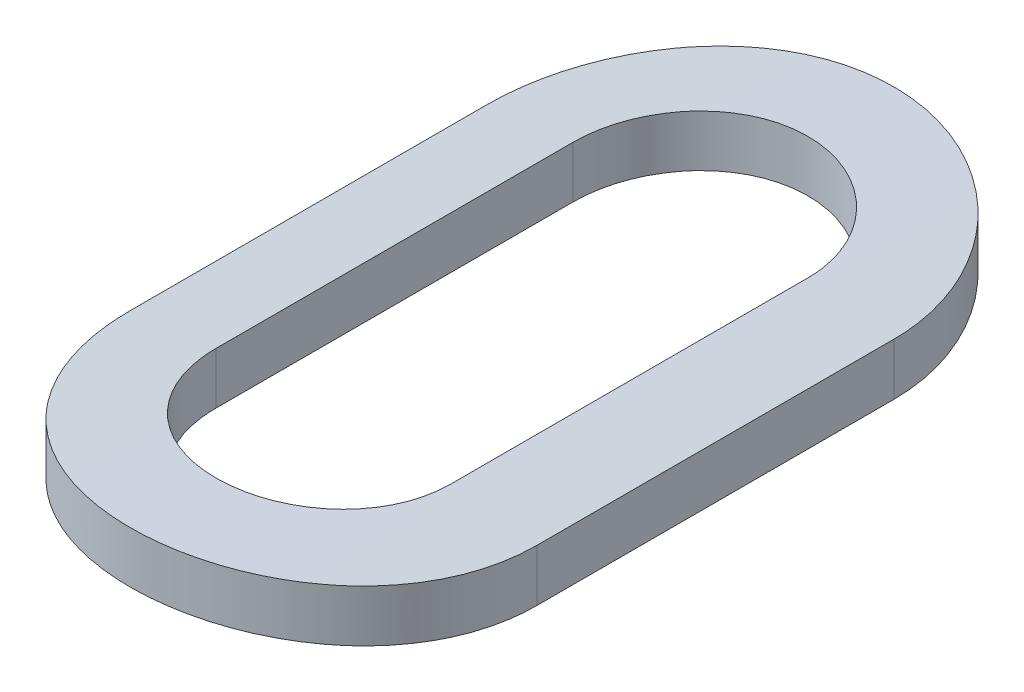
ISO-10303-21;
HEADER;
FILE_DESCRIPTION(('STEP AP214'),'2;1');
FILE_NAME('part.step','',(''),(''),'','','');
FILE_SCHEMA(('AUTOMOTIVE_DESIGN { 1 0 10303 214 1 1 1 1 }'));
ENDSEC;
DATA;
#1=APPLICATION_CONTEXT('core data for automotive mechanical design processes');
#2=APPLICATION_PROTOCOL_DEFINITION('international standard','automotive_design',2000,#1);
#3=PRODUCT_CONTEXT('',#1,'mechanical');
#4=PRODUCT('Part','Part','',(#3));
#5=PRODUCT_RELATED_PRODUCT_CATEGORY('part','',(#4));
#6=PRODUCT_DEFINITION_FORMATION('','',#4);
#7=PRODUCT_DEFINITION_CONTEXT('part definition',#1,'design');
#8=PRODUCT_DEFINITION('design','',#6,#7);
#9=PRODUCT_DEFINITION_SHAPE('','',#8);
#10=(LENGTH_UNIT() NAMED_UNIT(*) SI_UNIT(.MILLI.,.METRE.));
#11=(NAMED_UNIT(*) PLANE_ANGLE_UNIT() SI_UNIT($,.RADIAN.));
#12=(NAMED_UNIT(*) SI_UNIT($,.STERADIAN.) SOLID_ANGLE_UNIT());
#13=UNCERTAINTY_MEASURE_WITH_UNIT(LENGTH_MEASURE(1.E-05),#10,'distance_accuracy_value','');
#14=(GEOMETRIC_REPRESENTATION_CONTEXT(3) GLOBAL_UNCERTAINTY_ASSIGNED_CONTEXT((#13)) GLOBAL_UNIT_ASSIGNED_CONTEXT((#10,
#11,#12)) REPRESENTATION_CONTEXT('',''));
#15=CARTESIAN_POINT('',(0.,0.,0.));
#16=DIRECTION('',(0.,0.,1.));
#17=DIRECTION('',(1.,0.,0.));
#18=AXIS2_PLACEMENT_3D('',#15,#16,#17);
#19=CARTESIAN_POINT('',(-102.183303397109,-58.0021041199526,0.810125243112656));
#20=DIRECTION('',(0.,0.,1.));
#21=DIRECTION('',(1.,0.,0.));
#22=AXIS2_PLACEMENT_3D('',#19,#20,#21);
#23=CYLINDRICAL_SURFACE('',#22,3.15);
#24=CARTESIAN_POINT('',(-101.909719824805,-54.8640072398411,-0.418890375643534));
#25=CARTESIAN_POINT('',(-101.909706616778,-54.8640116038495,-0.403530028373171));
#26=CARTESIAN_POINT('',(-101.911012629097,-54.8638945821352,-0.38817424038909));
#27=CARTESIAN_POINT('',(-101.91616493209,-54.8634501023721,-0.357911416299882));
#28=CARTESIAN_POINT('',(-101.92000896244,-54.8631228315755,-0.343003993226904));
#29=CARTESIAN_POINT('',(-101.930141476108,-54.8622899162493,-0.31404292812646));
#30=CARTESIAN_POINT('',(-101.936430932495,-54.8617842007215,-0.299989628543862));
#31=CARTESIAN_POINT('',(-101.951269236735,-54.8606529156442,-0.273139788492567));
#32=CARTESIAN_POINT('',(-101.959817770308,-54.8600273627696,-0.260343073548946));
#33=CARTESIAN_POINT('',(-101.978957254186,-54.858724650616,-0.236333789711282));
#34=CARTESIAN_POINT('',(-101.989553004558,-54.85804737236,-0.225125053328532));
#35=CARTESIAN_POINT('',(-102.012477047229,-54.8567186189181,-0.204641380783918));
#36=CARTESIAN_POINT('',(-102.024805602851,-54.8560671476734,-0.195366739066538));
#37=CARTESIAN_POINT('',(-102.050868037135,-54.8548623045616,-0.179002980356575));
#38=CARTESIAN_POINT('',(-102.064604063545,-54.854309086249,-0.17191727177832));
#39=CARTESIAN_POINT('',(-102.093075660351,-54.8533644337177,-0.160154706174724));
#40=CARTESIAN_POINT('',(-102.107811151204,-54.8529729866417,-0.155477657705035));
#41=CARTESIAN_POINT('',(-102.13782470229,-54.8523967862496,-0.148675960509295));
#42=CARTESIAN_POINT('',(-102.153101299041,-54.8522115136778,-0.146544898648283));
#43=CARTESIAN_POINT('',(-102.1837967687,-54.8520667749047,-0.144875828745693));
#44=CARTESIAN_POINT('',(-102.199215642245,-54.8521073097163,-0.14533783233498));
#45=CARTESIAN_POINT('',(-102.229713640967,-54.8524091989506,-0.148836633865558));
#46=CARTESIAN_POINT('',(-102.244793572653,-54.8526699554928,-0.151866460495188));
#47=CARTESIAN_POINT('',(-102.274229971334,-54.8533822737681,-0.160404044909396));
#48=CARTESIAN_POINT('',(-102.288586434427,-54.8538338365303,-0.165911816057895));
#49=CARTESIAN_POINT('',(-102.31619086392,-54.8548780121511,-0.179256820528889));
#50=CARTESIAN_POINT('',(-102.3294372941,-54.8554708162598,-0.187097215990861));
#51=CARTESIAN_POINT('',(-102.354428176498,-54.8567308333417,-0.204882215873652));
#52=CARTESIAN_POINT('',(-102.366172664124,-54.8573980445601,-0.214826770676629));
#53=CARTESIAN_POINT('',(-102.387866258427,-54.8587344683245,-0.236575626553745));
#54=CARTESIAN_POINT('',(-102.397809554026,-54.8594036805078,-0.24838572472531));
#55=CARTESIAN_POINT('',(-102.415576264114,-54.8606667104951,-0.273514688596322));
#56=CARTESIAN_POINT('',(-102.423399026913,-54.8612605050917,-0.286834016338271));
#57=CARTESIAN_POINT('',(-102.436703008999,-54.8623058530949,-0.314611526163022));
#58=CARTESIAN_POINT('',(-102.442182501874,-54.8627573015633,-0.329070538656137));
#59=CARTESIAN_POINT('',(-102.450623831935,-54.863464474176,-0.358690444661327));
#60=CARTESIAN_POINT('',(-102.453589485952,-54.8637204949845,-0.373850237116434));
#61=CARTESIAN_POINT('',(-102.456347444913,-54.8639604241394,-0.39902404963354));
#62=CARTESIAN_POINT('',(-102.456891513284,-54.8640085803269,-0.408959691241275));
#63=CARTESIAN_POINT('',(-102.456886969413,-54.8640072398411,-0.418890375643533));
#64=B_SPLINE_CURVE_WITH_KNOTS('',3,(#24,#25,#26,#27,#28,#29,#30,#31,#32,#33,#34,#35,#36,#37,#38,
#39,#40,#41,#42,#43,#44,#45,#46,#47,#48,#49,#50,#51,#52,#53,#54,#55,#56,#57,#58,#59,#60,#61,#62,
#63),.UNSPECIFIED.,.F.,.F.,(4,2,2,2,2,2,2,2,2,2,2,2,2,2,2,2,2,2,2,4),(0.,0.0460185269940198,
0.0919961256717322,0.137992038231913,0.1839815552701,0.230080241017496,0.276185939663909,
0.322363072340171,0.368536534213803,0.414593441972147,0.460650556313077,0.506583030539255,
0.552515752488989,0.598511027446187,0.644505217917069,0.690645251790526,0.736799449546961,
0.782987593228106,0.829105481902413,0.858895844339714),.UNSPECIFIED.);
#65=CARTESIAN_POINT('',(-101.909719824806,-54.8640072398411,-0.418890375643534));
#66=VERTEX_POINT('',#65);
#67=CARTESIAN_POINT('',(-102.456886969413,-54.8640072398411,-0.418890375643531));
#68=VERTEX_POINT('',#67);
#69=EDGE_CURVE('E176',#66,#68,#64,.T.);
#70=ORIENTED_EDGE('',*,*,#69,.T.);
#71=DIRECTION('',(0.,0.,-1.));
#72=VECTOR('',#71,1.);
#73=CARTESIAN_POINT('',(-102.456886969413,-54.8640072398411,-0.418890375643534));
#74=LINE('',#73,#72);
#75=CARTESIAN_POINT('',(-102.456886969413,-54.8640072398411,-1.25058443544621));
#76=VERTEX_POINT('',#75);
#77=EDGE_CURVE('E112',#76,#68,#74,.F.);
#78=ORIENTED_EDGE('',*,*,#77,.F.);
#79=CARTESIAN_POINT('',(-102.456886969413,-54.8640072398411,-1.25058443544621));
#80=CARTESIAN_POINT('',(-102.45690017744,-54.8640116038495,-1.26594478271657));
#81=CARTESIAN_POINT('',(-102.455594165121,-54.8638945821352,-1.28130057070066));
#82=CARTESIAN_POINT('',(-102.450441862128,-54.8634501023721,-1.31156339478986));
#83=CARTESIAN_POINT('',(-102.446597831778,-54.8631228315755,-1.32647081786284));
#84=CARTESIAN_POINT('',(-102.43646531811,-54.8622899162493,-1.35543188296328));
#85=CARTESIAN_POINT('',(-102.430175861723,-54.8617842007215,-1.36948518254588));
#86=CARTESIAN_POINT('',(-102.415337557483,-54.8606529156442,-1.39633502259718));
#87=CARTESIAN_POINT('',(-102.40678902391,-54.8600273627696,-1.40913173754079));
#88=CARTESIAN_POINT('',(-102.387649540032,-54.858724650616,-1.43314102137846));
#89=CARTESIAN_POINT('',(-102.37705378966,-54.85804737236,-1.44434975776121));
#90=CARTESIAN_POINT('',(-102.354129746989,-54.8567186189181,-1.46483343030583));
#91=CARTESIAN_POINT('',(-102.341801191367,-54.8560671476734,-1.47410807202321));
#92=CARTESIAN_POINT('',(-102.315738757083,-54.8548623045616,-1.49047183073317));
#93=CARTESIAN_POINT('',(-102.302002730673,-54.854309086249,-1.49755753931142));
#94=CARTESIAN_POINT('',(-102.273531133867,-54.8533644337177,-1.50932010491502));
#95=CARTESIAN_POINT('',(-102.258795643014,-54.8529729866417,-1.51399715338471));
#96=CARTESIAN_POINT('',(-102.228782091928,-54.8523967862496,-1.52079885058045));
#97=CARTESIAN_POINT('',(-102.213505495177,-54.8522115136778,-1.52292991244146));
#98=CARTESIAN_POINT('',(-102.182810025518,-54.8520667749048,-1.52459898234405));
#99=CARTESIAN_POINT('',(-102.167391151973,-54.8521073097163,-1.52413697875476));
#100=CARTESIAN_POINT('',(-102.136893153251,-54.8524091989506,-1.52063817722419));
#101=CARTESIAN_POINT('',(-102.121813221565,-54.8526699554928,-1.51760835059456));
#102=CARTESIAN_POINT('',(-102.092376822884,-54.8533822737681,-1.50907076618035));
#103=CARTESIAN_POINT('',(-102.078020359791,-54.8538338365303,-1.50356299503185));
#104=CARTESIAN_POINT('',(-102.050415930298,-54.8548780121511,-1.49021799056086));
#105=CARTESIAN_POINT('',(-102.037169500118,-54.8554708162598,-1.48237759509889));
#106=CARTESIAN_POINT('',(-102.01217861772,-54.8567308333417,-1.4645925952161));
#107=CARTESIAN_POINT('',(-102.000434130094,-54.8573980445601,-1.45464804041312));
#108=CARTESIAN_POINT('',(-101.978740535791,-54.8587344683245,-1.432899184536));
#109=CARTESIAN_POINT('',(-101.968797240192,-54.8594036805078,-1.42108908636443));
#110=CARTESIAN_POINT('',(-101.951030530104,-54.8606667104951,-1.39596012249343));
#111=CARTESIAN_POINT('',(-101.943207767305,-54.8612605050917,-1.38264079475148));
#112=CARTESIAN_POINT('',(-101.929903785219,-54.8623058530949,-1.35486328492673));
#113=CARTESIAN_POINT('',(-101.924424292344,-54.8627573015633,-1.34040427243361));
#114=CARTESIAN_POINT('',(-101.915982962283,-54.863464474176,-1.31078436642842));
#115=CARTESIAN_POINT('',(-101.913017308266,-54.8637204949845,-1.29562457397331));
#116=CARTESIAN_POINT('',(-101.910259349305,-54.8639604241394,-1.2704507614562));
#117=CARTESIAN_POINT('',(-101.909715280934,-54.8640085803269,-1.26051511984847));
#118=CARTESIAN_POINT('',(-101.909719824805,-54.8640072398411,-1.25058443544621));
#119=B_SPLINE_CURVE_WITH_KNOTS('',3,(#79,#80,#81,#82,#83,#84,#85,#86,#87,#88,#89,#90,#91,#92,
#93,#94,#95,#96,#97,#98,#99,#100,#101,#102,#103,#104,#105,#106,#107,#108,#109,#110,#111,#112,
#113,#114,#115,#116,#117,#118),.UNSPECIFIED.,.F.,.F.,(4,2,2,2,2,2,2,2,2,2,2,2,2,2,2,2,2,2,2,4),
(0.,0.0460185269940224,0.091996125671732,0.137992038231907,0.1839815552701,0.230080241017498,
0.276185939663912,0.322363072340173,0.368536534213791,0.414593441972177,0.460650556313079,
0.506583030539243,0.552515752488991,0.598511027446175,0.644505217917071,0.690645251790527,
0.736799449546956,0.782987593228106,0.829105481902419,0.858895844339718),.UNSPECIFIED.);
#120=CARTESIAN_POINT('',(-101.909719824806,-54.8640072398411,-1.25058443544621));
#121=VERTEX_POINT('',#120);
#122=EDGE_CURVE('E118',#76,#121,#119,.T.);
#123=ORIENTED_EDGE('',*,*,#122,.T.);
#124=DIRECTION('',(0.,0.,1.));
#125=VECTOR('',#124,1.);
#126=CARTESIAN_POINT('',(-101.909719824806,-54.8640072398411,-1.25058443544621));
#127=LINE('',#126,#125);
#128=EDGE_CURVE('E116',#66,#121,#127,.F.);
#129=ORIENTED_EDGE('',*,*,#128,.F.);
#130=EDGE_LOOP('',(#70,#78,#123,#129));
#131=FACE_BOUND('',#130,.T.);
#132=CARTESIAN_POINT('',(-101.709719824805,-54.8879078191321,-0.418890323860368));
#133=CARTESIAN_POINT('',(-101.709696492865,-54.8879209899844,-0.39240705036457));
#134=CARTESIAN_POINT('',(-101.711939810205,-54.8875703535434,-0.365933959502038));
#135=CARTESIAN_POINT('',(-101.720783478108,-54.8862397001002,-0.31377335072766));
#136=CARTESIAN_POINT('',(-101.727378580234,-54.885260441282,-0.28808492547451));
#137=CARTESIAN_POINT('',(-101.74475263253,-54.8827700083777,-0.238184935240212));
#138=CARTESIAN_POINT('',(-101.755532693779,-54.8812586930441,-0.213973764437007));
#139=CARTESIAN_POINT('',(-101.780956537074,-54.8778791034408,-0.167703456009477));
#140=CARTESIAN_POINT('',(-101.795600220058,-54.8760108383234,-0.145644263229704));
#141=CARTESIAN_POINT('',(-101.828461112918,-54.8721102669835,-0.10412979247917));
#142=CARTESIAN_POINT('',(-101.846702912606,-54.8700768920481,-0.0846940761409741));
#143=CARTESIAN_POINT('',(-101.886190781335,-54.8660847856229,-0.0491454088645974));
#144=CARTESIAN_POINT('',(-101.907437308697,-54.8641260655785,-0.03303296575951));
#145=CARTESIAN_POINT('',(-101.952457002776,-54.8604928196241,-0.00451777151367476));
#146=CARTESIAN_POINT('',(-101.976241825816,-54.85881970532,0.00786677196642294));
#147=CARTESIAN_POINT('',(-102.025581944854,-54.8559582467044,0.0284571304238079));
#148=CARTESIAN_POINT('',(-102.051137044153,-54.8547698486355,0.0366634088157371));
#149=CARTESIAN_POINT('',(-102.103089601444,-54.8530191933645,0.0486053038081127));
#150=CARTESIAN_POINT('',(-102.129479277329,-54.8524522935884,0.0523740842867753));
#151=CARTESIAN_POINT('',(-102.182522768138,-54.8519925919176,0.0554370009187022));
#152=CARTESIAN_POINT('',(-102.209176574608,-54.8520997685168,0.0547312798293153));
#153=CARTESIAN_POINT('',(-102.261764051292,-54.852972459868,0.0488912279155397));
#154=CARTESIAN_POINT('',(-102.287701798253,-54.8537326524062,0.0437926983779292));
#155=CARTESIAN_POINT('',(-102.338349192261,-54.8558200203455,0.0293679912816208));
#156=CARTESIAN_POINT('',(-102.363058814914,-54.8571472070043,0.0200417297806604));
#157=CARTESIAN_POINT('',(-102.410657467529,-54.8602286128657,-0.0026105337575881));
#158=CARTESIAN_POINT('',(-102.433539184418,-54.8619844435167,-0.015951674480513));
#159=CARTESIAN_POINT('',(-102.476751701943,-54.8657273526383,-0.0462433576385448));
#160=CARTESIAN_POINT('',(-102.497082434177,-54.8677144373068,-0.0631939968234982));
#161=CARTESIAN_POINT('',(-102.534825523433,-54.8717213079679,-0.100420582228535));
#162=CARTESIAN_POINT('',(-102.552207472631,-54.8737412238628,-0.120727357771732));
#163=CARTESIAN_POINT('',(-102.583326379682,-54.8775675941772,-0.16399211379684));
#164=CARTESIAN_POINT('',(-102.597062281244,-54.879373986653,-0.186950859819213));
#165=CARTESIAN_POINT('',(-102.620504927211,-54.8825697303999,-0.234906850913294));
#166=CARTESIAN_POINT('',(-102.630206162811,-54.8839585107652,-0.259906827698897));
#167=CARTESIAN_POINT('',(-102.64524517629,-54.8861498267168,-0.311177092500361));
#168=CARTESIAN_POINT('',(-102.650589495233,-54.8869532409232,-0.337445413303508));
#169=CARTESIAN_POINT('',(-102.655823634853,-54.887746817989,-0.382198596881947));
#170=CARTESIAN_POINT('',(-102.656896597268,-54.8879127395768,-0.400548409691752));
#171=CARTESIAN_POINT('',(-102.656886969413,-54.8879078191321,-0.418890382116421));
#172=B_SPLINE_CURVE_WITH_KNOTS('',3,(#132,#133,#134,#135,#136,#137,#138,#139,#140,#141,#142,
#143,#144,#145,#146,#147,#148,#149,#150,#151,#152,#153,#154,#155,#156,#157,#158,#159,#160,#161,
#162,#163,#164,#165,#166,#167,#168,#169,#170,#171),.UNSPECIFIED.,.F.,.F.,(4,2,2,2,2,2,2,2,2,2,2,
2,2,2,2,2,2,2,2,4),(0.,0.0793374676688889,0.158579425415151,0.237842435764248,0.317103414059127,
0.396926108189397,0.476760991092278,0.556979699299973,0.637189508448984,0.716795981712112,
0.796399915172377,0.875361150028912,0.954323952741475,1.03358830832387,1.1128547887942,
1.19289461903249,1.27295761226681,1.35312956490032,1.43318093210799,1.48819665364523),.UNSPECIFIED.);
#173=CARTESIAN_POINT('',(-101.709719824806,-54.8879078191321,-0.418890349751951));
#174=VERTEX_POINT('',#173);
#175=CARTESIAN_POINT('',(-102.656886969413,-54.8879078191321,-0.418890378879978));
#176=VERTEX_POINT('',#175);
#177=EDGE_CURVE('E99',#174,#176,#172,.T.);
#178=ORIENTED_EDGE('',*,*,#177,.F.);
#179=DIRECTION('',(0.,0.,1.));
#180=VECTOR('',#179,1.);
#181=CARTESIAN_POINT('',(-101.709719824806,-54.8879078191321,-0.418890272077202));
#182=LINE('',#181,#180);
#183=CARTESIAN_POINT('',(-101.709719824806,-54.8879078191321,-1.25058438366311));
#184=VERTEX_POINT('',#183);
#185=EDGE_CURVE('E97',#184,#174,#182,.T.);
#186=ORIENTED_EDGE('',*,*,#185,.F.);
#187=CARTESIAN_POINT('',(-102.656886969413,-54.8879078191321,-1.25058447409274));
#188=CARTESIAN_POINT('',(-102.656910302088,-54.8879209900964,-1.27706774756906));
#189=CARTESIAN_POINT('',(-102.654666985485,-54.8875703537674,-1.30354083847693));
#190=CARTESIAN_POINT('',(-102.64582331904,-54.8862397005361,-1.35570144746633));
#191=CARTESIAN_POINT('',(-102.639228217635,-54.885260441818,-1.38138987288902));
#192=CARTESIAN_POINT('',(-102.621854166742,-54.8827700090902,-1.43128986358205));
#193=CARTESIAN_POINT('',(-102.611074106176,-54.8812586938332,-1.45550103467446));
#194=CARTESIAN_POINT('',(-102.585650264192,-54.8778791043511,-1.50177134378968));
#195=CARTESIAN_POINT('',(-102.571006581835,-54.8760108392784,-1.52383053696795));
#196=CARTESIAN_POINT('',(-102.538145690166,-54.8721102679918,-1.5653450086137));
#197=CARTESIAN_POINT('',(-102.519903891042,-54.8700768930647,-1.58478072544977));
#198=CARTESIAN_POINT('',(-102.480416023352,-54.8660847866181,-1.62032939381093));
#199=CARTESIAN_POINT('',(-102.459169496466,-54.8641260665438,-1.63644183750291));
#200=CARTESIAN_POINT('',(-102.414149803219,-54.8604928204924,-1.66495703301507));
#201=CARTESIAN_POINT('',(-102.390364980531,-54.8588197061212,-1.67734157717113));
#202=CARTESIAN_POINT('',(-102.341024862078,-54.855958247344,-1.6979319370309));
#203=CARTESIAN_POINT('',(-102.315469763012,-54.8547698491805,-1.70613821614922));
#204=CARTESIAN_POINT('',(-102.263517206039,-54.8530191937036,-1.71808011262294));
#205=CARTESIAN_POINT('',(-102.237127530239,-54.8524522938167,-1.72184889385308));
#206=CARTESIAN_POINT('',(-102.18408403947,-54.8519925919211,-1.72491181198771));
#207=CARTESIAN_POINT('',(-102.157430232955,-54.8520997684063,-1.72420609164956));
#208=CARTESIAN_POINT('',(-102.104842756073,-54.8529724595397,-1.71836604121084));
#209=CARTESIAN_POINT('',(-102.078905008959,-54.8537326519737,-1.71326751240013));
#210=CARTESIAN_POINT('',(-102.028257614526,-54.8558200197244,-1.69884280671947));
#211=CARTESIAN_POINT('',(-102.003547991602,-54.857147206299,-1.68951654590737));
#212=CARTESIAN_POINT('',(-101.95594933836,-54.8602286120189,-1.66686428370498));
#213=CARTESIAN_POINT('',(-101.933067621112,-54.8619844426125,-1.65352314363307));
#214=CARTESIAN_POINT('',(-101.889855102765,-54.865727351654,-1.62323146171063));
#215=CARTESIAN_POINT('',(-101.869524370068,-54.8677144363,-1.60628082310995));
#216=CARTESIAN_POINT('',(-101.831781279783,-54.8717213069543,-1.56905423879216));
#217=CARTESIAN_POINT('',(-101.81439933002,-54.8737412228654,-1.54874746375019));
#218=CARTESIAN_POINT('',(-101.783280421766,-54.8775675932484,-1.50548270863787));
#219=CARTESIAN_POINT('',(-101.769544519566,-54.8793739857769,-1.48252396302793));
#220=CARTESIAN_POINT('',(-101.746101872248,-54.882569729663,-1.43456797262803));
#221=CARTESIAN_POINT('',(-101.736400635937,-54.8839585101147,-1.40956799612265));
#222=CARTESIAN_POINT('',(-101.721361620993,-54.8861498262599,-1.35829773174014));
#223=CARTESIAN_POINT('',(-101.716017301302,-54.8869532405728,-1.33202941107424));
#224=CARTESIAN_POINT('',(-101.710783158129,-54.8877468181773,-1.28727620816064));
#225=CARTESIAN_POINT('',(-101.70971019517,-54.8879127398579,-1.26892637567137));
#226=CARTESIAN_POINT('',(-101.709719824805,-54.8879078191321,-1.25058438366311));
#227=B_SPLINE_CURVE_WITH_KNOTS('',3,(#187,#188,#189,#190,#191,#192,#193,#194,#195,#196,#197,
#198,#199,#200,#201,#202,#203,#204,#205,#206,#207,#208,#209,#210,#211,#212,#213,#214,#215,#216,
#217,#218,#219,#220,#221,#222,#223,#224,#225,#226),.UNSPECIFIED.,.F.,.F.,(4,2,2,2,2,2,2,2,2,2,2,
2,2,2,2,2,2,2,2,4),(0.,0.0793374676133149,0.158579425303989,0.237842435599049,0.317103413839528,
0.396926107901833,0.476760990737497,0.556979698958267,0.637189508120671,0.716795981456612,
0.796399914989487,0.875361149866088,0.954323952596814,1.0335883081135,1.11285478852488,
1.19289461872715,1.27295761189825,1.3531295645229,1.43318093182312,1.48819671199166),.UNSPECIFIED.);
#228=CARTESIAN_POINT('',(-102.656886969413,-54.8879078191321,-1.25058446121056));
#229=VERTEX_POINT('',#228);
#230=EDGE_CURVE('E21',#229,#184,#227,.T.);
#231=ORIENTED_EDGE('',*,*,#230,.F.);
#232=DIRECTION('',(0.,0.,1.));
#233=VECTOR('',#232,1.);
#234=CARTESIAN_POINT('',(-102.656886969413,-54.8879078191321,-1.25058453850363));
#235=LINE('',#234,#233);
#236=EDGE_CURVE('E84',#176,#229,#235,.F.);
#237=ORIENTED_EDGE('',*,*,#236,.F.);
#238=EDGE_LOOP('',(#178,#186,#231,#237));
#239=FACE_BOUND('',#238,.T.);
#240=ADVANCED_FACE('F17',(#131,#239),#23,.T.);
#241=CARTESIAN_POINT('',(-101.709719824806,-53.4571041199525,-0.418890272077202));
#242=DIRECTION('',(1.,0.,0.));
#243=DIRECTION('',(0.,1.,0.));
#244=AXIS2_PLACEMENT_3D('',#241,#242,#243);
#245=PLANE('',#244);
#246=DIRECTION('',(0.,0.,1.));
#247=VECTOR('',#246,1.);
#248=CARTESIAN_POINT('',(-101.709719824806,-55.0093430870526,0.810125243112656));
#249=LINE('',#248,#247);
#250=CARTESIAN_POINT('',(-101.709719824806,-55.0093430870527,-0.418890349751951));
#251=VERTEX_POINT('',#250);
#252=CARTESIAN_POINT('',(-101.709719824806,-55.0093430870527,-1.25058438366311));
#253=VERTEX_POINT('',#252);
#254=EDGE_CURVE('E106',#251,#253,#249,.F.);
#255=ORIENTED_EDGE('',*,*,#254,.T.);
#256=DIRECTION('',(0.,1.,0.));
#257=VECTOR('',#256,1.);
#258=CARTESIAN_POINT('',(-101.709719824805,-53.4571041199525,-1.25058438366311));
#259=LINE('',#258,#257);
#260=EDGE_CURVE('E93',#184,#253,#259,.F.);
#261=ORIENTED_EDGE('',*,*,#260,.F.);
#262=ORIENTED_EDGE('',*,*,#185,.T.);
#263=DIRECTION('',(0.,1.,0.));
#264=VECTOR('',#263,1.);
#265=CARTESIAN_POINT('',(-101.709719824805,-53.4571041199525,-0.418890323860368));
#266=LINE('',#265,#264);
#267=EDGE_CURVE('E168',#251,#174,#266,.T.);
#268=ORIENTED_EDGE('',*,*,#267,.F.);
#269=EDGE_LOOP('',(#255,#261,#262,#268));
#270=FACE_BOUND('',#269,.T.);
#271=ADVANCED_FACE('F105',(#270),#245,.T.);
#272=CARTESIAN_POINT('',(-102.183303397109,-53.4571041199525,-1.25058443544621));
#273=DIRECTION('',(0.,1.,0.));
#274=DIRECTION('',(-1.,0.,0.));
#275=AXIS2_PLACEMENT_3D('',#272,#273,#274);
#276=CYLINDRICAL_SURFACE('',#275,0.473583572303524);
#277=ORIENTED_EDGE('',*,*,#260,.T.);
#278=CARTESIAN_POINT('',(-101.709719824805,-55.0093430870527,-1.25058438366311));
#279=CARTESIAN_POINT('',(-101.709696430582,-55.0093567924447,-1.27705476519391));
#280=CARTESIAN_POINT('',(-101.711937626391,-55.0089922713787,-1.30351468488855));
#281=CARTESIAN_POINT('',(-101.720772168695,-55.0076090712904,-1.35564789140437));
#282=CARTESIAN_POINT('',(-101.727360106891,-55.0065912052151,-1.38132211431999));
#283=CARTESIAN_POINT('',(-101.744714069052,-55.0040028168435,-1.43119382264451));
#284=CARTESIAN_POINT('',(-101.755481134979,-55.002432156731,-1.45539093803113));
#285=CARTESIAN_POINT('',(-101.780873254659,-54.9989200165159,-1.5016359639766));
#286=CARTESIAN_POINT('',(-101.795498262187,-54.9969785408566,-1.52368390028248));
#287=CARTESIAN_POINT('',(-101.828326325673,-54.9929238710529,-1.56519258149378));
#288=CARTESIAN_POINT('',(-101.846555931232,-54.9908094754672,-1.58463221494108));
#289=CARTESIAN_POINT('',(-101.886020000792,-54.9866579482435,-1.6201917316975));
#290=CARTESIAN_POINT('',(-101.907254923651,-54.9846208284646,-1.6363111071382));
#291=CARTESIAN_POINT('',(-101.952262885613,-54.9808407892872,-1.66484925093383));
#292=CARTESIAN_POINT('',(-101.976048571439,-54.9790994579058,-1.67724830234782));
#293=CARTESIAN_POINT('',(-102.02539533403,-54.9761207620847,-1.69786659921923));
#294=CARTESIAN_POINT('',(-102.050956206688,-54.9748833398185,-1.70608632430359));
#295=CARTESIAN_POINT('',(-102.102908774638,-54.9730602946523,-1.71804872589592));
#296=CARTESIAN_POINT('',(-102.129292037745,-54.972469460444,-1.72182721604216));
#297=CARTESIAN_POINT('',(-102.182324897172,-54.9719882800269,-1.72491117381889));
#298=CARTESIAN_POINT('',(-102.208974483797,-54.9720979084121,-1.72421680368173));
#299=CARTESIAN_POINT('',(-102.261537582172,-54.9730011773732,-1.71840272790128));
#300=CARTESIAN_POINT('',(-102.287455486929,-54.9737888429389,-1.71332167749034));
#301=CARTESIAN_POINT('',(-102.338066073985,-54.9759530172036,-1.69893925428986));
#302=CARTESIAN_POINT('',(-102.362758730068,-54.9773295384964,-1.68963779123882));
#303=CARTESIAN_POINT('',(-102.410334734976,-54.9805270244874,-1.66703923170168));
#304=CARTESIAN_POINT('',(-102.433210254117,-54.9823497874977,-1.65372591641164));
#305=CARTESIAN_POINT('',(-102.476416234917,-54.9862367270591,-1.62349399073432));
#306=CARTESIAN_POINT('',(-102.496746613036,-54.9883009115301,-1.6065752620541));
#307=CARTESIAN_POINT('',(-102.534511872395,-54.9924666020471,-1.56940010421064));
#308=CARTESIAN_POINT('',(-102.55191393462,-54.9945682720705,-1.54911033760304));
#309=CARTESIAN_POINT('',(-102.583076181719,-54.9985512918196,-1.50587499212814));
#310=CARTESIAN_POINT('',(-102.59683531752,-55.0004325779935,-1.48292865096139));
#311=CARTESIAN_POINT('',(-102.620327981257,-55.0037628592246,-1.43498862738245));
#312=CARTESIAN_POINT('',(-102.630055560853,-55.0052112146448,-1.4099919844938));
#313=CARTESIAN_POINT('',(-102.645146547578,-55.0074985019123,-1.35872157707879));
#314=CARTESIAN_POINT('',(-102.650516490256,-55.0083383461964,-1.33244978796374));
#315=CARTESIAN_POINT('',(-102.655807427629,-55.0091729918493,-1.28755439966048));
#316=CARTESIAN_POINT('',(-102.656896826605,-55.0093483254315,-1.26906558352818));
#317=CARTESIAN_POINT('',(-102.656886969413,-55.0093430870527,-1.25058447409274));
#318=B_SPLINE_CURVE_WITH_KNOTS('',3,(#278,#279,#280,#281,#282,#283,#284,#285,#286,#287,#288,
#289,#290,#291,#292,#293,#294,#295,#296,#297,#298,#299,#300,#301,#302,#303,#304,#305,#306,#307,
#308,#309,#310,#311,#312,#313,#314,#315,#316,#317),.UNSPECIFIED.,.F.,.F.,(4,2,2,2,2,2,2,2,2,2,2,
2,2,2,2,2,2,2,2,4),(0.,0.0792982860291018,0.158498093207799,0.237717659571721,0.316936276773923,
0.396761705769601,0.476599335852234,0.556852904139628,0.637097260304501,0.716689995968125,
0.796279844789041,0.875175427850105,0.954072698321892,1.03329330798992,1.11251651727183,
1.19257573875601,1.27265799030134,1.35285798175002,1.4329374664257,1.48836957031141),.UNSPECIFIED.);
#319=CARTESIAN_POINT('',(-102.656886969413,-55.0093430870528,-1.25058446121056));
#320=VERTEX_POINT('',#319);
#321=EDGE_CURVE('E150',#253,#320,#318,.T.);
#322=ORIENTED_EDGE('',*,*,#321,.T.);
#323=DIRECTION('',(0.,-1.,0.));
#324=VECTOR('',#323,1.);
#325=CARTESIAN_POINT('',(-102.656886969413,-53.4571041199525,-1.25058448697492));
#326=LINE('',#325,#324);
#327=EDGE_CURVE('E95',#229,#320,#326,.T.);
#328=ORIENTED_EDGE('',*,*,#327,.F.);
#329=ORIENTED_EDGE('',*,*,#230,.T.);
#330=EDGE_LOOP('',(#277,#322,#328,#329));
#331=FACE_BOUND('',#330,.T.);
#332=ADVANCED_FACE('F90',(#331),#276,.T.);
#333=CARTESIAN_POINT('',(-102.656886969413,-53.4571041199525,-1.25058453850363));
#334=DIRECTION('',(-1.,0.,0.));
#335=DIRECTION('',(0.,-1.,0.));
#336=AXIS2_PLACEMENT_3D('',#333,#334,#335);
#337=PLANE('',#336);
#338=DIRECTION('',(0.,0.,1.));
#339=VECTOR('',#338,1.);
#340=CARTESIAN_POINT('',(-102.656886969413,-55.0093430870528,0.810125243112656));
#341=LINE('',#340,#339);
#342=CARTESIAN_POINT('',(-102.656886969413,-55.0093430870527,-0.418890378879978));
#343=VERTEX_POINT('',#342);
#344=EDGE_CURVE('E149',#320,#343,#341,.T.);
#345=ORIENTED_EDGE('',*,*,#344,.T.);
#346=DIRECTION('',(0.,1.,0.));
#347=VECTOR('',#346,1.);
#348=CARTESIAN_POINT('',(-102.656886969413,-53.4571041199525,-0.418890375643534));
#349=LINE('',#348,#347);
#350=EDGE_CURVE('E115',#176,#343,#349,.F.);
#351=ORIENTED_EDGE('',*,*,#350,.F.);
#352=ORIENTED_EDGE('',*,*,#236,.T.);
#353=ORIENTED_EDGE('',*,*,#327,.T.);
#354=EDGE_LOOP('',(#345,#351,#352,#353));
#355=FACE_BOUND('',#354,.T.);
#356=ADVANCED_FACE('F161',(#355),#337,.T.);
#357=CARTESIAN_POINT('',(-102.183303397109,-53.4571041199525,-0.418890375643534));
#358=DIRECTION('',(0.,1.,0.));
#359=DIRECTION('',(-1.,0.,0.));
#360=AXIS2_PLACEMENT_3D('',#357,#358,#359);
#361=CYLINDRICAL_SURFACE('',#360,0.473583572303524);
#362=ORIENTED_EDGE('',*,*,#350,.T.);
#363=CARTESIAN_POINT('',(-102.656886969413,-55.0093430870527,-0.418890382116421));
#364=CARTESIAN_POINT('',(-102.656910361103,-55.0093567920431,-0.392420000513125));
#365=CARTESIAN_POINT('',(-102.654669162751,-55.0089922705753,-0.3659600809699));
#366=CARTESIAN_POINT('',(-102.645834615419,-55.0076090697261,-0.313826875186354));
#367=CARTESIAN_POINT('',(-102.639246674737,-55.0065912032917,-0.288152652851056));
#368=CARTESIAN_POINT('',(-102.621892707731,-55.0040028142859,-0.238280946100355));
#369=CARTESIAN_POINT('',(-102.611125639447,-55.0024321538984,-0.214083831707238));
#370=CARTESIAN_POINT('',(-102.585733515241,-54.9989200132476,-0.16783880812574));
#371=CARTESIAN_POINT('',(-102.571108505545,-54.9969785374274,-0.145790873190371));
#372=CARTESIAN_POINT('',(-102.538280437941,-54.9929238674313,-0.104282195058935));
#373=CARTESIAN_POINT('',(-102.520050830433,-54.990809471815,-0.0848425633253136));
#374=CARTESIAN_POINT('',(-102.48058675727,-54.9866579446673,-0.0492830503049956));
#375=CARTESIAN_POINT('',(-102.459351832758,-54.9846208249948,-0.0331636768866324));
#376=CARTESIAN_POINT('',(-102.414343867915,-54.9808407861651,-0.00462553746242171));
#377=CARTESIAN_POINT('',(-102.390558180871,-54.9790994550245,0.00777351161542915));
#378=CARTESIAN_POINT('',(-102.341211416255,-54.9761207597839,0.0283918036396785));
#379=CARTESIAN_POINT('',(-102.315650542789,-54.9748833378576,0.0366115262131033));
#380=CARTESIAN_POINT('',(-102.263697973744,-54.9730602934315,0.048573922684602));
#381=CARTESIAN_POINT('',(-102.237314710349,-54.9724694596212,0.0523524102339537));
#382=CARTESIAN_POINT('',(-102.184281850795,-54.9719882800114,0.0554363628197126));
#383=CARTESIAN_POINT('',(-102.15763226433,-54.9720979088058,0.0547419900884109));
#384=CARTESIAN_POINT('',(-102.105069166648,-54.9730011785483,0.0489279092178013));
#385=CARTESIAN_POINT('',(-102.07915126242,-54.9737888444881,0.0438468562993188));
#386=CARTESIAN_POINT('',(-102.028540676831,-54.9759530194293,0.0294644282163278));
#387=CARTESIAN_POINT('',(-102.003848021686,-54.9773295410245,0.020162962790142));
#388=CARTESIAN_POINT('',(-101.95627201894,-54.9805270275236,-0.00243560135509266));
#389=CARTESIAN_POINT('',(-101.933396501032,-54.982349790741,-0.0157489188926487));
#390=CARTESIAN_POINT('',(-101.890190523055,-54.9862367305918,-0.0459808488400509));
#391=CARTESIAN_POINT('',(-101.869860146527,-54.9883009151451,-0.0628995795425276));
#392=CARTESIAN_POINT('',(-101.832094890698,-54.9924666056903,-0.100074741160847));
#393=CARTESIAN_POINT('',(-101.814692830414,-54.9945682756581,-0.120364509515814));
#394=CARTESIAN_POINT('',(-101.783530587464,-54.9985512951627,-0.163599858158271));
#395=CARTESIAN_POINT('',(-101.769771453872,-55.0004325811476,-0.186546200745961));
#396=CARTESIAN_POINT('',(-101.746278794825,-55.0037628618773,-0.234486226690683));
#397=CARTESIAN_POINT('',(-101.736551217695,-55.0052112169866,-0.259482870515962));
#398=CARTESIAN_POINT('',(-101.721460236026,-55.0074985035563,-0.310753279352528));
#399=CARTESIAN_POINT('',(-101.716090295933,-55.0083383474543,-0.337025068951463));
#400=CARTESIAN_POINT('',(-101.710799365292,-55.0091729920542,-0.381920438004688));
#401=CARTESIAN_POINT('',(-101.709709968151,-55.0093483253353,-0.400409234271202));
#402=CARTESIAN_POINT('',(-101.709719824805,-55.0093430870527,-0.418890323860369));
#403=B_SPLINE_CURVE_WITH_KNOTS('',3,(#363,#364,#365,#366,#367,#368,#369,#370,#371,#372,#373,
#374,#375,#376,#377,#378,#379,#380,#381,#382,#383,#384,#385,#386,#387,#388,#389,#390,#391,#392,
#393,#394,#395,#396,#397,#398,#399,#400,#401,#402),.UNSPECIFIED.,.F.,.F.,(4,2,2,2,2,2,2,2,2,2,2,
2,2,2,2,2,2,2,2,4),(0.,0.0792982862364216,0.158498093622461,0.23771766018792,0.316936277593047,
0.396761706842616,0.476599337176395,0.556852905415222,0.637097261530252,0.716689996921954,
0.796279845472058,0.875175428459882,0.954072698861753,1.03329330876508,1.11251651827549,
1.19257573993302,1.27265799167701,1.35285798302085,1.43293746749066,1.48836951196534),.UNSPECIFIED.);
#404=EDGE_CURVE('E142',#343,#251,#403,.T.);
#405=ORIENTED_EDGE('',*,*,#404,.T.);
#406=ORIENTED_EDGE('',*,*,#267,.T.);
#407=ORIENTED_EDGE('',*,*,#177,.T.);
#408=EDGE_LOOP('',(#362,#405,#406,#407));
#409=FACE_BOUND('',#408,.T.);
#410=ADVANCED_FACE('F155',(#409),#361,.T.);
#411=CARTESIAN_POINT('',(-102.456886969413,-53.4571041199525,-0.418890375643534));
#412=DIRECTION('',(1.,0.,0.));
#413=DIRECTION('',(0.,0.,-1.));
#414=AXIS2_PLACEMENT_3D('',#411,#412,#413);
#415=PLANE('',#414);
#416=DIRECTION('',(0.,0.,1.));
#417=VECTOR('',#416,1.);
#418=CARTESIAN_POINT('',(-102.456886969413,-54.9844805468465,0.810125243112656));
#419=LINE('',#418,#417);
#420=CARTESIAN_POINT('',(-102.456886969413,-54.9844805468465,-0.418890375643533));
#421=VERTEX_POINT('',#420);
#422=CARTESIAN_POINT('',(-102.456886969413,-54.9844805468465,-1.25058443544621));
#423=VERTEX_POINT('',#422);
#424=EDGE_CURVE('E148',#421,#423,#419,.F.);
#425=ORIENTED_EDGE('',*,*,#424,.T.);
#426=DIRECTION('',(0.,1.,0.));
#427=VECTOR('',#426,1.);
#428=CARTESIAN_POINT('',(-102.456886969413,-53.4571041199525,-1.25058443544621));
#429=LINE('',#428,#427);
#430=EDGE_CURVE('E114',#423,#76,#429,.T.);
#431=ORIENTED_EDGE('',*,*,#430,.T.);
#432=ORIENTED_EDGE('',*,*,#77,.T.);
#433=DIRECTION('',(0.,1.,0.));
#434=VECTOR('',#433,1.);
#435=CARTESIAN_POINT('',(-102.456886969413,-53.4571041199525,-0.418890375643532));
#436=LINE('',#435,#434);
#437=EDGE_CURVE('E204',#68,#421,#436,.F.);
#438=ORIENTED_EDGE('',*,*,#437,.T.);
#439=EDGE_LOOP('',(#425,#431,#432,#438));
#440=FACE_BOUND('',#439,.T.);
#441=ADVANCED_FACE('F160',(#440),#415,.T.);
#442=CARTESIAN_POINT('',(-102.183303397109,-53.4571041199525,-1.25058443544621));
#443=DIRECTION('',(0.,1.,0.));
#444=DIRECTION('',(-1.,0.,0.));
#445=AXIS2_PLACEMENT_3D('',#442,#443,#444);
#446=CYLINDRICAL_SURFACE('',#445,0.273583572303518);
#447=DIRECTION('',(0.,-1.,0.));
#448=VECTOR('',#447,1.);
#449=CARTESIAN_POINT('',(-101.909719824806,-53.4571041199525,-1.25058443544621));
#450=LINE('',#449,#448);
#451=CARTESIAN_POINT('',(-101.909719824806,-54.9844805468465,-1.25058443544621));
#452=VERTEX_POINT('',#451);
#453=EDGE_CURVE('E117',#121,#452,#450,.T.);
#454=ORIENTED_EDGE('',*,*,#453,.F.);
#455=ORIENTED_EDGE('',*,*,#122,.F.);
#456=ORIENTED_EDGE('',*,*,#430,.F.);
#457=CARTESIAN_POINT('',(-102.456886969413,-54.9844805468465,-1.25058443544621));
#458=CARTESIAN_POINT('',(-102.45690018856,-54.9844850850065,-1.26594230880658));
#459=CARTESIAN_POINT('',(-102.455594583745,-54.9843634291541,-1.28129556968992));
#460=CARTESIAN_POINT('',(-102.450444037557,-54.9839013638385,-1.31155313436555));
#461=CARTESIAN_POINT('',(-102.446601388075,-54.9835611518201,-1.32645783068318));
#462=CARTESIAN_POINT('',(-102.43647274975,-54.982695325965,-1.35541346846432));
#463=CARTESIAN_POINT('',(-102.430185801304,-54.9821696393207,-1.36946407211301));
#464=CARTESIAN_POINT('',(-102.41535362176,-54.9809936958497,-1.39630907161444));
#465=CARTESIAN_POINT('',(-102.406808694357,-54.9803434557786,-1.4091036360852));
#466=CARTESIAN_POINT('',(-102.387675519313,-54.9789891929714,-1.43311185884475));
#467=CARTESIAN_POINT('',(-102.37708208878,-54.9782850366116,-1.44432137958294));
#468=CARTESIAN_POINT('',(-102.354162558468,-54.976903511139,-1.46480719554321));
#469=CARTESIAN_POINT('',(-102.341836195345,-54.9762261461177,-1.47408319640831));
#470=CARTESIAN_POINT('',(-102.315775963507,-54.9749732653347,-1.49045136433836));
#471=CARTESIAN_POINT('',(-102.30203976608,-54.9743979225072,-1.49753983817741));
#472=CARTESIAN_POINT('',(-102.273566893701,-54.9734154280022,-1.50930772549867));
#473=CARTESIAN_POINT('',(-102.258830299632,-54.9730082627462,-1.51398733347577));
#474=CARTESIAN_POINT('',(-102.228816839615,-54.9724089065577,-1.52079293233058));
#475=CARTESIAN_POINT('',(-102.213541557574,-54.9722161320768,-1.52292585617706));
#476=CARTESIAN_POINT('',(-102.182848304728,-54.9720652956585,-1.52459899115645));
#477=CARTESIAN_POINT('',(-102.167430333496,-54.972107234425,-1.52413919451447));
#478=CARTESIAN_POINT('',(-102.13693723616,-54.9724206277345,-1.52064550122764));
#479=CARTESIAN_POINT('',(-102.121861239453,-54.9726914108666,-1.5176191346017));
#480=CARTESIAN_POINT('',(-102.092432133361,-54.9734312715637,-1.50908994007897));
#481=CARTESIAN_POINT('',(-102.078079028347,-54.9739003503275,-1.50358709721227));
#482=CARTESIAN_POINT('',(-102.050478912772,-54.9749852107613,-1.4902526863554));
#483=CARTESIAN_POINT('',(-102.037233555316,-54.9756012065815,-1.48241771482069));
#484=CARTESIAN_POINT('',(-102.012243656792,-54.9769106737635,-1.46464431848652));
#485=CARTESIAN_POINT('',(-102.00049908344,-54.9776041434581,-1.45470593894653));
#486=CARTESIAN_POINT('',(-101.978800875656,-54.9789935419706,-1.43296688073402));
#487=CARTESIAN_POINT('',(-101.968853536883,-54.9796894710466,-1.42115991733846));
#488=CARTESIAN_POINT('',(-101.951078187108,-54.9810031213351,-1.39603627162654));
#489=CARTESIAN_POINT('',(-101.943250825879,-54.9816208185386,-1.38271912821073));
#490=CARTESIAN_POINT('',(-101.929937183968,-54.9827084570826,-1.35494453696847));
#491=CARTESIAN_POINT('',(-101.924452666358,-54.9831782870781,-1.34048624004406));
#492=CARTESIAN_POINT('',(-101.916001398058,-54.9839144740036,-1.31086648875109));
#493=CARTESIAN_POINT('',(-101.913030832485,-54.9841811391716,-1.29570613675049));
#494=CARTESIAN_POINT('',(-101.910262288898,-54.9844315961996,-1.27050475649978));
#495=CARTESIAN_POINT('',(-101.90971524255,-54.9844819522347,-1.26054212270765));
#496=CARTESIAN_POINT('',(-101.909719824805,-54.9844805468465,-1.25058443544621));
#497=B_SPLINE_CURVE_WITH_KNOTS('',3,(#457,#458,#459,#460,#461,#462,#463,#464,#465,#466,#467,
#468,#469,#470,#471,#472,#473,#474,#475,#476,#477,#478,#479,#480,#481,#482,#483,#484,#485,#486,
#487,#488,#489,#490,#491,#492,#493,#494,#495,#496),.UNSPECIFIED.,.F.,.F.,(4,2,2,2,2,2,2,2,2,2,2,
2,2,2,2,2,2,2,2,4),(0.,0.0460110092394265,0.0919805102672458,0.137968076626714,
0.183949460880798,0.230048741249598,0.276155034605758,0.32233874916102,0.368518734199204,
0.414572712346623,0.460626828597784,0.506546292990866,0.552466034963514,0.598453124267894,
0.644439224158955,0.690583414231268,0.736741731520296,0.78293472360329,0.829057492186301,
0.858928716261789),.UNSPECIFIED.);
#498=EDGE_CURVE('E125',#423,#452,#497,.T.);
#499=ORIENTED_EDGE('',*,*,#498,.T.);
#500=EDGE_LOOP('',(#454,#455,#456,#499));
#501=FACE_BOUND('',#500,.T.);
#502=ADVANCED_FACE('F180',(#501),#446,.F.);
#503=CARTESIAN_POINT('',(-101.909719824806,-53.4571041199525,-1.25058443544621));
#504=DIRECTION('',(-1.,0.,0.));
#505=DIRECTION('',(0.,-1.,0.));
#506=AXIS2_PLACEMENT_3D('',#503,#504,#505);
#507=PLANE('',#506);
#508=DIRECTION('',(0.,0.,1.));
#509=VECTOR('',#508,1.);
#510=CARTESIAN_POINT('',(-101.909719824806,-54.9844805468465,0.810125243112656));
#511=LINE('',#510,#509);
#512=CARTESIAN_POINT('',(-101.909719824806,-54.9844805468465,-0.418890375643534));
#513=VERTEX_POINT('',#512);
#514=EDGE_CURVE('E31',#452,#513,#511,.T.);
#515=ORIENTED_EDGE('',*,*,#514,.T.);
#516=DIRECTION('',(0.,1.,0.));
#517=VECTOR('',#516,1.);
#518=CARTESIAN_POINT('',(-101.909719824805,-53.4571041199525,-0.418890375643534));
#519=LINE('',#518,#517);
#520=EDGE_CURVE('E39',#513,#66,#519,.T.);
#521=ORIENTED_EDGE('',*,*,#520,.T.);
#522=ORIENTED_EDGE('',*,*,#128,.T.);
#523=ORIENTED_EDGE('',*,*,#453,.T.);
#524=EDGE_LOOP('',(#515,#521,#522,#523));
#525=FACE_BOUND('',#524,.T.);
#526=ADVANCED_FACE('F183',(#525),#507,.T.);
#527=CARTESIAN_POINT('',(-102.183303397109,-53.4571041199525,-0.418890375643534));
#528=DIRECTION('',(0.,1.,0.));
#529=DIRECTION('',(-1.,0.,0.));
#530=AXIS2_PLACEMENT_3D('',#527,#528,#529);
#531=CYLINDRICAL_SURFACE('',#530,0.273583572303518);
#532=ORIENTED_EDGE('',*,*,#437,.F.);
#533=ORIENTED_EDGE('',*,*,#69,.F.);
#534=ORIENTED_EDGE('',*,*,#520,.F.);
#535=CARTESIAN_POINT('',(-101.909719824805,-54.9844805468465,-0.418890375643534));
#536=CARTESIAN_POINT('',(-101.909706605658,-54.9844850850065,-0.403532502283168));
#537=CARTESIAN_POINT('',(-101.911012210473,-54.9843634291541,-0.388179241399829));
#538=CARTESIAN_POINT('',(-101.916162756661,-54.9839013638385,-0.357921676724193));
#539=CARTESIAN_POINT('',(-101.920005406143,-54.9835611518201,-0.343016980406565));
#540=CARTESIAN_POINT('',(-101.930134044468,-54.982695325965,-0.314061342625418));
#541=CARTESIAN_POINT('',(-101.936420992914,-54.9821696393207,-0.300010738976726));
#542=CARTESIAN_POINT('',(-101.951253172458,-54.9809936958497,-0.273165739475296));
#543=CARTESIAN_POINT('',(-101.959798099861,-54.9803434557786,-0.260371175004542));
#544=CARTESIAN_POINT('',(-101.978931274905,-54.9789891929714,-0.236362952244985));
#545=CARTESIAN_POINT('',(-101.989524705438,-54.9782850366116,-0.225153431506796));
#546=CARTESIAN_POINT('',(-102.01244423575,-54.976903511139,-0.204667615546528));
#547=CARTESIAN_POINT('',(-102.024770598873,-54.9762261461177,-0.195391614681433));
#548=CARTESIAN_POINT('',(-102.050830830711,-54.9749732653347,-0.179023446751387));
#549=CARTESIAN_POINT('',(-102.064567028138,-54.9743979225072,-0.171934972912332));
#550=CARTESIAN_POINT('',(-102.093039900517,-54.9734154280022,-0.160167085591076));
#551=CARTESIAN_POINT('',(-102.107776494586,-54.9730082627462,-0.155487477613975));
#552=CARTESIAN_POINT('',(-102.137789954603,-54.9724089065577,-0.148681878759169));
#553=CARTESIAN_POINT('',(-102.153065236644,-54.9722161320768,-0.146548954912685));
#554=CARTESIAN_POINT('',(-102.18375848949,-54.9720652956585,-0.144875819933297));
#555=CARTESIAN_POINT('',(-102.199176460722,-54.972107234425,-0.145335616575274));
#556=CARTESIAN_POINT('',(-102.229669558058,-54.9724206277345,-0.148829309862104));
#557=CARTESIAN_POINT('',(-102.244745554765,-54.9726914108666,-0.151855676488046));
#558=CARTESIAN_POINT('',(-102.274174660857,-54.9734312715637,-0.160384871010781));
#559=CARTESIAN_POINT('',(-102.288527765871,-54.9739003503275,-0.165887713877476));
#560=CARTESIAN_POINT('',(-102.316127881446,-54.9749852107613,-0.179222124734339));
#561=CARTESIAN_POINT('',(-102.329373238902,-54.9756012065815,-0.187057096269052));
#562=CARTESIAN_POINT('',(-102.354363137426,-54.9769106737635,-0.204830492603227));
#563=CARTESIAN_POINT('',(-102.366107710778,-54.9776041434581,-0.214768872143216));
#564=CARTESIAN_POINT('',(-102.387805918562,-54.9789935419706,-0.236507930355725));
#565=CARTESIAN_POINT('',(-102.397753257335,-54.9796894710466,-0.248314893751279));
#566=CARTESIAN_POINT('',(-102.41552860711,-54.9810031213351,-0.273438539463203));
#567=CARTESIAN_POINT('',(-102.423355968339,-54.9816208185386,-0.286755682879008));
#568=CARTESIAN_POINT('',(-102.43666961025,-54.9827084570826,-0.314530274121271));
#569=CARTESIAN_POINT('',(-102.44215412786,-54.9831782870781,-0.328988571045683));
#570=CARTESIAN_POINT('',(-102.45060539616,-54.9839144740036,-0.358608322338656));
#571=CARTESIAN_POINT('',(-102.453575961733,-54.9841811391716,-0.373768674339257));
#572=CARTESIAN_POINT('',(-102.45634450532,-54.9844315961996,-0.398970054589962));
#573=CARTESIAN_POINT('',(-102.456891551668,-54.9844819522347,-0.408932688382094));
#574=CARTESIAN_POINT('',(-102.456886969413,-54.9844805468465,-0.418890375643534));
#575=B_SPLINE_CURVE_WITH_KNOTS('',3,(#535,#536,#537,#538,#539,#540,#541,#542,#543,#544,#545,
#546,#547,#548,#549,#550,#551,#552,#553,#554,#555,#556,#557,#558,#559,#560,#561,#562,#563,#564,
#565,#566,#567,#568,#569,#570,#571,#572,#573,#574),.UNSPECIFIED.,.F.,.F.,(4,2,2,2,2,2,2,2,2,2,2,
2,2,2,2,2,2,2,2,4),(0.,0.0460110092394275,0.0919805102672439,0.137968076626727,
0.183949460880794,0.230048741249613,0.276155034605754,0.322338749161016,0.3685187341992,
0.414572712346619,0.46062682859778,0.506546292990891,0.55246603496351,0.59845312426789,
0.644439224158951,0.690583414231272,0.736741731520293,0.782934723603287,0.829057492186299,
0.858928716261787),.UNSPECIFIED.);
#576=EDGE_CURVE('E11',#513,#421,#575,.T.);
#577=ORIENTED_EDGE('',*,*,#576,.T.);
#578=EDGE_LOOP('',(#532,#533,#534,#577));
#579=FACE_BOUND('',#578,.T.);
#580=ADVANCED_FACE('F131',(#579),#531,.F.);
#581=CARTESIAN_POINT('',(-102.183303397109,-58.0021041199526,0.810125243112656));
#582=DIRECTION('',(0.,0.,1.));
#583=DIRECTION('',(1.,0.,0.));
#584=AXIS2_PLACEMENT_3D('',#581,#582,#583);
#585=CYLINDRICAL_SURFACE('',#584,3.03);
#586=ORIENTED_EDGE('',*,*,#514,.F.);
#587=ORIENTED_EDGE('',*,*,#498,.F.);
#588=ORIENTED_EDGE('',*,*,#424,.F.);
#589=ORIENTED_EDGE('',*,*,#576,.F.);
#590=EDGE_LOOP('',(#586,#587,#588,#589));
#591=FACE_BOUND('',#590,.T.);
#592=ORIENTED_EDGE('',*,*,#344,.F.);
#593=ORIENTED_EDGE('',*,*,#321,.F.);
#594=ORIENTED_EDGE('',*,*,#254,.F.);
#595=ORIENTED_EDGE('',*,*,#404,.F.);
#596=EDGE_LOOP('',(#592,#593,#594,#595));
#597=FACE_BOUND('',#596,.T.);
#598=ADVANCED_FACE('F134',(#591,#597),#585,.F.);
#599=CLOSED_SHELL('',(#240,#271,#332,#356,#410,#441,#502,#526,#580,#598));
#600=MANIFOLD_SOLID_BREP('B1',#599);
#601=ADVANCED_BREP_SHAPE_REPRESENTATION('',(#18,#600),#14);
#602=SHAPE_DEFINITION_REPRESENTATION(#9,#601);
ENDSEC;
END-ISO-10303-21;
